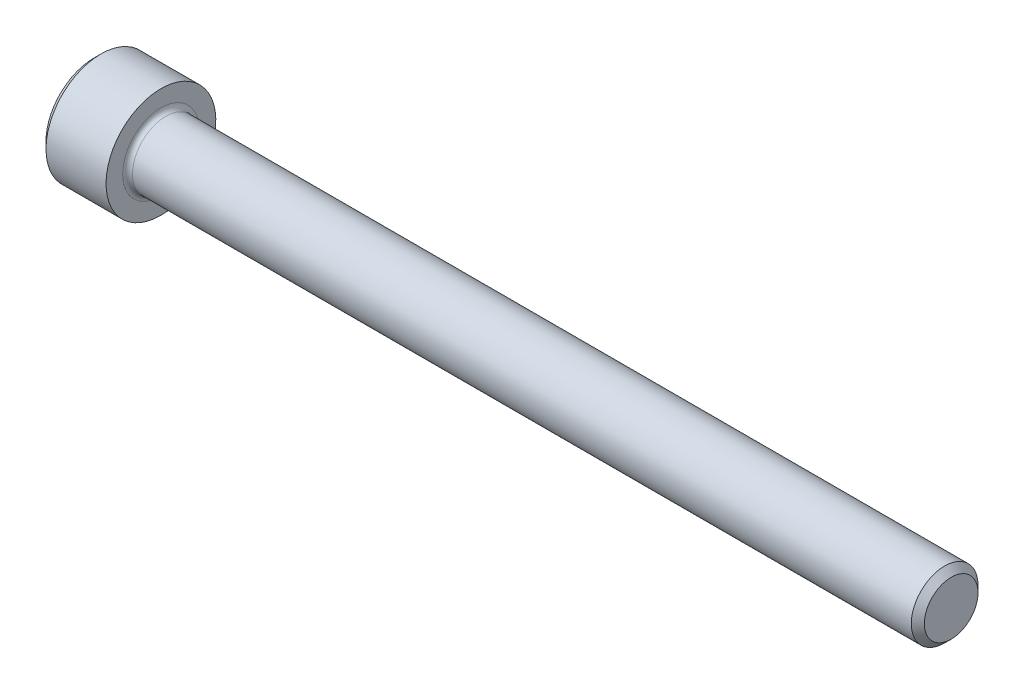
ISO-10303-21;
HEADER;
FILE_DESCRIPTION(('STEP AP214'),'2;1');
FILE_NAME('part.step','',(''),(''),'','','');
FILE_SCHEMA(('AUTOMOTIVE_DESIGN { 1 0 10303 214 1 1 1 1 }'));
ENDSEC;
DATA;
#1=APPLICATION_CONTEXT('core data for automotive mechanical design processes');
#2=APPLICATION_PROTOCOL_DEFINITION('international standard','automotive_design',2000,#1);
#3=PRODUCT_CONTEXT('',#1,'mechanical');
#4=PRODUCT('Part','Part','',(#3));
#5=PRODUCT_RELATED_PRODUCT_CATEGORY('part','',(#4));
#6=PRODUCT_DEFINITION_FORMATION('','',#4);
#7=PRODUCT_DEFINITION_CONTEXT('part definition',#1,'design');
#8=PRODUCT_DEFINITION('design','',#6,#7);
#9=PRODUCT_DEFINITION_SHAPE('','',#8);
#10=(LENGTH_UNIT() NAMED_UNIT(*) SI_UNIT(.MILLI.,.METRE.));
#11=(NAMED_UNIT(*) PLANE_ANGLE_UNIT() SI_UNIT($,.RADIAN.));
#12=(NAMED_UNIT(*) SI_UNIT($,.STERADIAN.) SOLID_ANGLE_UNIT());
#13=UNCERTAINTY_MEASURE_WITH_UNIT(LENGTH_MEASURE(1.E-05),#10,'distance_accuracy_value','');
#14=(GEOMETRIC_REPRESENTATION_CONTEXT(3) GLOBAL_UNCERTAINTY_ASSIGNED_CONTEXT((#13)) GLOBAL_UNIT_ASSIGNED_CONTEXT((#10,
#11,#12)) REPRESENTATION_CONTEXT('',''));
#15=CARTESIAN_POINT('',(0.,0.,0.));
#16=DIRECTION('',(0.,0.,1.));
#17=DIRECTION('',(1.,0.,0.));
#18=AXIS2_PLACEMENT_3D('',#15,#16,#17);
#19=CARTESIAN_POINT('',(2.28599999999835,1.14604605784489,1.98500999999814));
#20=DIRECTION('',(-1.,0.,0.));
#21=DIRECTION('',(0.,0.,1.));
#22=AXIS2_PLACEMENT_3D('',#19,#20,#21);
#23=PLANE('',#22);
#24=DIRECTION('',(0.,0.500000000000225,0.866025403784309));
#25=VECTOR('',#24,1.);
#26=CARTESIAN_POINT('',(2.28599999999835,-1.71906908676475,0.992504999998419));
#27=LINE('',#26,#25);
#28=CARTESIAN_POINT('',(2.2860000000244,-1.71906908676435,0.992504999999121));
#29=VERTEX_POINT('',#28);
#30=CARTESIAN_POINT('',(2.2859999999985,-1.14604605784269,1.98500999999785));
#31=VERTEX_POINT('',#30);
#32=EDGE_CURVE('E101',#29,#31,#27,.T.);
#33=ORIENTED_EDGE('',*,*,#32,.T.);
#34=DIRECTION('',(0.,1.,0.));
#35=VECTOR('',#34,1.);
#36=CARTESIAN_POINT('',(2.28599999999835,1.14604605784489,1.98500999999737));
#37=LINE('',#36,#35);
#38=CARTESIAN_POINT('',(2.28600000005282,6.16970951828022E-13,1.98500999997034));
#39=VERTEX_POINT('',#38);
#40=EDGE_CURVE('E96',#31,#39,#37,.T.);
#41=ORIENTED_EDGE('',*,*,#40,.T.);
#42=CARTESIAN_POINT('',(2.28600000005045,5.68989300120264E-13,0.));
#43=DIRECTION('',(-1.,0.,0.));
#44=DIRECTION('',(0.,-1.,0.));
#45=AXIS2_PLACEMENT_3D('',#42,#43,#44);
#46=CIRCLE('',#45,1.98500999999842);
#47=EDGE_CURVE('E98',#39,#29,#46,.F.);
#48=ORIENTED_EDGE('',*,*,#47,.T.);
#49=EDGE_LOOP('',(#33,#41,#48));
#50=FACE_BOUND('',#49,.T.);
#51=ADVANCED_FACE('F17',(#50),#23,.T.);
#52=CARTESIAN_POINT('',(2.28599999999835,1.14604605784489,1.98500999999814));
#53=DIRECTION('',(-1.,0.,0.));
#54=DIRECTION('',(0.,0.,1.));
#55=AXIS2_PLACEMENT_3D('',#52,#53,#54);
#56=PLANE('',#55);
#57=DIRECTION('',(0.,-0.499999999999518,0.866025403784717));
#58=VECTOR('',#57,1.);
#59=CARTESIAN_POINT('',(2.28599999999836,-1.71906908676538,-0.992505000001581));
#60=LINE('',#59,#58);
#61=CARTESIAN_POINT('',(2.28600000002441,-1.71906908676604,-0.992505000000433));
#62=VERTEX_POINT('',#61);
#63=CARTESIAN_POINT('',(2.28599999999843,-2.2920921156869,-1.20750667849807E-12));
#64=VERTEX_POINT('',#63);
#65=EDGE_CURVE('E105',#62,#64,#60,.T.);
#66=ORIENTED_EDGE('',*,*,#65,.T.);
#67=DIRECTION('',(0.,0.500000000000257,0.86602540378429));
#68=VECTOR('',#67,1.);
#69=CARTESIAN_POINT('',(2.28599999999835,-2.29209211568694,-1.14318277066872E-12));
#70=LINE('',#69,#68);
#71=EDGE_CURVE('E172',#64,#29,#70,.T.);
#72=ORIENTED_EDGE('',*,*,#71,.T.);
#73=CARTESIAN_POINT('',(2.28600000005045,5.68989300120264E-13,0.));
#74=DIRECTION('',(-1.,0.,0.));
#75=DIRECTION('',(0.,-1.,0.));
#76=AXIS2_PLACEMENT_3D('',#73,#74,#75);
#77=CIRCLE('',#76,1.98500999999842);
#78=EDGE_CURVE('E117',#29,#62,#77,.F.);
#79=ORIENTED_EDGE('',*,*,#78,.T.);
#80=EDGE_LOOP('',(#66,#72,#79));
#81=FACE_BOUND('',#80,.T.);
#82=ADVANCED_FACE('F348',(#81),#56,.T.);
#83=CARTESIAN_POINT('',(2.28599999999835,1.14604605784489,1.98500999999814));
#84=DIRECTION('',(-1.,0.,0.));
#85=DIRECTION('',(0.,0.,1.));
#86=AXIS2_PLACEMENT_3D('',#83,#84,#85);
#87=PLANE('',#86);
#88=DIRECTION('',(0.,1.,0.));
#89=VECTOR('',#88,1.);
#90=CARTESIAN_POINT('',(2.28599999999838,1.14604605784489,-1.98501000000155));
#91=LINE('',#90,#89);
#92=CARTESIAN_POINT('',(2.28600000002441,2.17891246317544E-12,-1.98500999999995));
#93=VERTEX_POINT('',#92);
#94=CARTESIAN_POINT('',(2.28599999999847,-1.14604605784331,-1.98501000000144));
#95=VERTEX_POINT('',#94);
#96=EDGE_CURVE('E167',#93,#95,#91,.F.);
#97=ORIENTED_EDGE('',*,*,#96,.T.);
#98=DIRECTION('',(0.,-0.499999999999995,0.866025403784441));
#99=VECTOR('',#98,1.);
#100=CARTESIAN_POINT('',(2.28599999999837,-1.14604605784323,-1.98501000000176));
#101=LINE('',#100,#99);
#102=EDGE_CURVE('E162',#95,#62,#101,.T.);
#103=ORIENTED_EDGE('',*,*,#102,.T.);
#104=CARTESIAN_POINT('',(2.28600000005045,5.68989300120264E-13,0.));
#105=DIRECTION('',(-1.,0.,0.));
#106=DIRECTION('',(0.,-1.,0.));
#107=AXIS2_PLACEMENT_3D('',#104,#105,#106);
#108=CIRCLE('',#107,1.98500999999842);
#109=EDGE_CURVE('E225',#62,#93,#108,.F.);
#110=ORIENTED_EDGE('',*,*,#109,.T.);
#111=EDGE_LOOP('',(#97,#103,#110));
#112=FACE_BOUND('',#111,.T.);
#113=ADVANCED_FACE('F345',(#112),#87,.T.);
#114=CARTESIAN_POINT('',(2.28599999999835,1.14604605784489,1.98500999999814));
#115=DIRECTION('',(-1.,0.,0.));
#116=DIRECTION('',(0.,0.,1.));
#117=AXIS2_PLACEMENT_3D('',#114,#115,#116);
#118=PLANE('',#117);
#119=DIRECTION('',(0.,-0.49999999999959,-0.866025403784675));
#120=VECTOR('',#119,1.);
#121=CARTESIAN_POINT('',(2.28599999999837,1.71906908676735,-0.992504999999861));
#122=LINE('',#121,#120);
#123=CARTESIAN_POINT('',(2.28600000002441,1.71906908676674,-0.99250500000091));
#124=VERTEX_POINT('',#123);
#125=CARTESIAN_POINT('',(2.28599999999829,1.14604605784539,-1.98501000000123));
#126=VERTEX_POINT('',#125);
#127=EDGE_CURVE('E157',#124,#126,#122,.T.);
#128=ORIENTED_EDGE('',*,*,#127,.T.);
#129=DIRECTION('',(0.,1.,0.));
#130=VECTOR('',#129,1.);
#131=CARTESIAN_POINT('',(2.28599999999838,1.14604605784489,-1.98501000000112));
#132=LINE('',#131,#130);
#133=EDGE_CURVE('E152',#126,#93,#132,.F.);
#134=ORIENTED_EDGE('',*,*,#133,.T.);
#135=CARTESIAN_POINT('',(2.28600000005045,5.68989300120264E-13,0.));
#136=DIRECTION('',(-1.,0.,0.));
#137=DIRECTION('',(0.,-1.,0.));
#138=AXIS2_PLACEMENT_3D('',#135,#136,#137);
#139=CIRCLE('',#138,1.98500999999842);
#140=EDGE_CURVE('E222',#93,#124,#139,.F.);
#141=ORIENTED_EDGE('',*,*,#140,.T.);
#142=EDGE_LOOP('',(#128,#134,#141));
#143=FACE_BOUND('',#142,.T.);
#144=ADVANCED_FACE('F341',(#143),#118,.T.);
#145=CARTESIAN_POINT('',(2.28599999999835,1.14604605784489,1.98500999999814));
#146=DIRECTION('',(-1.,0.,0.));
#147=DIRECTION('',(0.,0.,1.));
#148=AXIS2_PLACEMENT_3D('',#145,#146,#147);
#149=PLANE('',#148);
#150=DIRECTION('',(0.,0.499999999999661,-0.866025403784634));
#151=VECTOR('',#150,1.);
#152=CARTESIAN_POINT('',(2.28599999999836,1.71906908676721,0.99250499999967));
#153=LINE('',#152,#151);
#154=CARTESIAN_POINT('',(2.28600000002441,1.71906908676643,0.992504999999222));
#155=VERTEX_POINT('',#154);
#156=CARTESIAN_POINT('',(2.28599999999834,2.29209211568984,-1.46634293093318E-12));
#157=VERTEX_POINT('',#156);
#158=EDGE_CURVE('E147',#155,#157,#153,.T.);
#159=ORIENTED_EDGE('',*,*,#158,.T.);
#160=DIRECTION('',(0.,-0.5000000000009,-0.866025403783919));
#161=VECTOR('',#160,1.);
#162=CARTESIAN_POINT('',(2.28599999999837,2.29209211568962,-1.85441939581921E-12));
#163=LINE('',#162,#161);
#164=EDGE_CURVE('E118',#157,#124,#163,.T.);
#165=ORIENTED_EDGE('',*,*,#164,.T.);
#166=CARTESIAN_POINT('',(2.28600000005045,5.68989300120264E-13,0.));
#167=DIRECTION('',(-1.,0.,0.));
#168=DIRECTION('',(0.,-1.,0.));
#169=AXIS2_PLACEMENT_3D('',#166,#167,#168);
#170=CIRCLE('',#169,1.98500999999842);
#171=EDGE_CURVE('E125',#124,#155,#170,.F.);
#172=ORIENTED_EDGE('',*,*,#171,.T.);
#173=EDGE_LOOP('',(#159,#165,#172));
#174=FACE_BOUND('',#173,.T.);
#175=ADVANCED_FACE('F337',(#174),#149,.T.);
#176=CARTESIAN_POINT('',(2.28600000008327,5.68989300120182E-13,0.));
#177=DIRECTION('',(-1.,0.,0.));
#178=DIRECTION('',(0.,-1.,0.));
#179=AXIS2_PLACEMENT_3D('',#176,#177,#178);
#180=CONICAL_SURFACE('',#179,1.98500999994158,1.04719755112651);
#181=CARTESIAN_POINT('',(3.43204605798064,5.66110570412242E-13,-1.70530256582424E-10));
#182=VERTEX_POINT('',#181);
#183=VERTEX_LOOP('',#182);
#184=FACE_BOUND('',#183,.T.);
#185=ORIENTED_EDGE('',*,*,#47,.F.);
#186=CARTESIAN_POINT('',(2.28600000005045,5.68989300120264E-13,0.));
#187=DIRECTION('',(-1.,0.,0.));
#188=DIRECTION('',(0.,-1.,0.));
#189=AXIS2_PLACEMENT_3D('',#186,#187,#188);
#190=CIRCLE('',#189,1.98500999999842);
#191=EDGE_CURVE('E113',#155,#39,#190,.F.);
#192=ORIENTED_EDGE('',*,*,#191,.F.);
#193=ORIENTED_EDGE('',*,*,#171,.F.);
#194=ORIENTED_EDGE('',*,*,#140,.F.);
#195=ORIENTED_EDGE('',*,*,#109,.F.);
#196=ORIENTED_EDGE('',*,*,#78,.F.);
#197=EDGE_LOOP('',(#185,#192,#193,#194,#195,#196));
#198=FACE_BOUND('',#197,.T.);
#199=ADVANCED_FACE('F111',(#184,#198),#180,.F.);
#200=CARTESIAN_POINT('',(2.28599999999835,1.14604605784489,1.98500999999814));
#201=DIRECTION('',(-1.,0.,0.));
#202=DIRECTION('',(0.,0.,1.));
#203=AXIS2_PLACEMENT_3D('',#200,#201,#202);
#204=PLANE('',#203);
#205=DIRECTION('',(0.,-1.,0.));
#206=VECTOR('',#205,1.);
#207=CARTESIAN_POINT('',(2.28599999999971,-1.14604605784296,1.98500999999737));
#208=LINE('',#207,#206);
#209=CARTESIAN_POINT('',(2.28599999999887,1.14604605784516,1.98500999999781));
#210=VERTEX_POINT('',#209);
#211=EDGE_CURVE('E122',#39,#210,#208,.F.);
#212=ORIENTED_EDGE('',*,*,#211,.T.);
#213=DIRECTION('',(0.,0.499999999999962,-0.866025403784461));
#214=VECTOR('',#213,1.);
#215=CARTESIAN_POINT('',(2.28599999999788,2.29209211568962,-1.85441939581921E-12));
#216=LINE('',#215,#214);
#217=EDGE_CURVE('E124',#155,#210,#216,.F.);
#218=ORIENTED_EDGE('',*,*,#217,.F.);
#219=ORIENTED_EDGE('',*,*,#191,.T.);
#220=EDGE_LOOP('',(#212,#218,#219));
#221=FACE_BOUND('',#220,.T.);
#222=ADVANCED_FACE('F121',(#221),#204,.T.);
#223=CARTESIAN_POINT('',(2.28599999999811,2.29209211568962,-1.85441939581921E-12));
#224=DIRECTION('',(0.,-0.866025403784461,-0.499999999999962));
#225=DIRECTION('',(0.,0.499999999999962,-0.866025403784461));
#226=AXIS2_PLACEMENT_3D('',#223,#224,#225);
#227=PLANE('',#226);
#228=ORIENTED_EDGE('',*,*,#217,.T.);
#229=DIRECTION('',(1.,0.,0.));
#230=VECTOR('',#229,1.);
#231=CARTESIAN_POINT('',(2.2859999999998,1.14604605784489,1.98500999999745));
#232=LINE('',#231,#230);
#233=CARTESIAN_POINT('',(-1.2572594047228E-12,1.14604605784547,1.98500999999848));
#234=VERTEX_POINT('',#233);
#235=EDGE_CURVE('E130',#210,#234,#232,.F.);
#236=ORIENTED_EDGE('',*,*,#235,.T.);
#237=DIRECTION('',(0.,-0.500000000000009,0.866025403784434));
#238=VECTOR('',#237,1.);
#239=CARTESIAN_POINT('',(0.,2.29209211569044,-7.75421393761609E-13));
#240=LINE('',#239,#238);
#241=CARTESIAN_POINT('',(-1.16700531643483E-12,2.29209211568985,-1.06945976891909E-12));
#242=VERTEX_POINT('',#241);
#243=EDGE_CURVE('E137',#242,#234,#240,.T.);
#244=ORIENTED_EDGE('',*,*,#243,.F.);
#245=DIRECTION('',(1.,0.,0.));
#246=VECTOR('',#245,1.);
#247=CARTESIAN_POINT('',(2.28599999999811,2.29209211569029,-6.905694719215E-13));
#248=LINE('',#247,#246);
#249=EDGE_CURVE('E187',#242,#157,#248,.T.);
#250=ORIENTED_EDGE('',*,*,#249,.T.);
#251=ORIENTED_EDGE('',*,*,#158,.F.);
#252=EDGE_LOOP('',(#228,#236,#244,#250,#251));
#253=FACE_BOUND('',#252,.T.);
#254=ADVANCED_FACE('F329',(#253),#227,.T.);
#255=CARTESIAN_POINT('',(2.2859999999998,-1.14604605784296,1.98500999999737));
#256=DIRECTION('',(0.,0.,1.));
#257=DIRECTION('',(0.,-1.,0.));
#258=AXIS2_PLACEMENT_3D('',#255,#256,#257);
#259=PLANE('',#258);
#260=ORIENTED_EDGE('',*,*,#235,.F.);
#261=ORIENTED_EDGE('',*,*,#211,.F.);
#262=ORIENTED_EDGE('',*,*,#40,.F.);
#263=DIRECTION('',(1.,0.,0.));
#264=VECTOR('',#263,1.);
#265=CARTESIAN_POINT('',(2.2859999999998,-1.14604605784213,1.98500999999881));
#266=LINE('',#265,#264);
#267=CARTESIAN_POINT('',(-1.19364663922646E-12,-1.14604605784313,1.98500999999827));
#268=VERTEX_POINT('',#267);
#269=EDGE_CURVE('E132',#268,#31,#266,.T.);
#270=ORIENTED_EDGE('',*,*,#269,.F.);
#271=DIRECTION('',(0.,1.,0.));
#272=VECTOR('',#271,1.);
#273=CARTESIAN_POINT('',(0.,0.,1.98500999999957));
#274=LINE('',#273,#272);
#275=EDGE_CURVE('E363',#234,#268,#274,.F.);
#276=ORIENTED_EDGE('',*,*,#275,.F.);
#277=EDGE_LOOP('',(#260,#261,#262,#270,#276));
#278=FACE_BOUND('',#277,.T.);
#279=ADVANCED_FACE('F128',(#278),#259,.F.);
#280=CARTESIAN_POINT('',(2.2859999999998,-1.14604605784296,1.98500999999737));
#281=DIRECTION('',(0.,0.866025403784442,-0.499999999999995));
#282=DIRECTION('',(0.,0.499999999999995,0.866025403784442));
#283=AXIS2_PLACEMENT_3D('',#280,#281,#282);
#284=PLANE('',#283);
#285=ORIENTED_EDGE('',*,*,#71,.F.);
#286=DIRECTION('',(1.,0.,0.));
#287=VECTOR('',#286,1.);
#288=CARTESIAN_POINT('',(2.28599999999899,-2.29209211568683,-1.33577502339642E-12));
#289=LINE('',#288,#287);
#290=CARTESIAN_POINT('',(-1.1376832416176E-12,-2.29209211568637,-1.26755017421369E-12));
#291=VERTEX_POINT('',#290);
#292=EDGE_CURVE('E198',#291,#64,#289,.T.);
#293=ORIENTED_EDGE('',*,*,#292,.F.);
#294=DIRECTION('',(0.,-0.499999999999382,-0.866025403784796));
#295=VECTOR('',#294,1.);
#296=CARTESIAN_POINT('',(0.,-1.14604605784346,1.98500999999958));
#297=LINE('',#296,#295);
#298=EDGE_CURVE('E361',#268,#291,#297,.T.);
#299=ORIENTED_EDGE('',*,*,#298,.F.);
#300=ORIENTED_EDGE('',*,*,#269,.T.);
#301=ORIENTED_EDGE('',*,*,#32,.F.);
#302=EDGE_LOOP('',(#285,#293,#299,#300,#301));
#303=FACE_BOUND('',#302,.T.);
#304=ADVANCED_FACE('F322',(#303),#284,.T.);
#305=CARTESIAN_POINT('',(2.28599999999899,-2.29209211568694,-1.14318277066872E-12));
#306=DIRECTION('',(0.,0.86602540378446,0.499999999999963));
#307=DIRECTION('',(0.,-0.499999999999963,0.86602540378446));
#308=AXIS2_PLACEMENT_3D('',#305,#306,#307);
#309=PLANE('',#308);
#310=ORIENTED_EDGE('',*,*,#102,.F.);
#311=DIRECTION('',(1.,0.,0.));
#312=VECTOR('',#311,1.);
#313=CARTESIAN_POINT('',(2.28599999999705,-1.14604605784323,-1.9850100000012));
#314=LINE('',#313,#312);
#315=CARTESIAN_POINT('',(-1.28757993453517E-12,-1.14604605784309,-1.98501000000162));
#316=VERTEX_POINT('',#315);
#317=EDGE_CURVE('E191',#95,#316,#314,.F.);
#318=ORIENTED_EDGE('',*,*,#317,.T.);
#319=DIRECTION('',(0.,0.499999999999133,-0.866025403784939));
#320=VECTOR('',#319,1.);
#321=CARTESIAN_POINT('',(0.,-2.29209211568589,-7.91033905045413E-13));
#322=LINE('',#321,#320);
#323=EDGE_CURVE('E358',#291,#316,#322,.T.);
#324=ORIENTED_EDGE('',*,*,#323,.F.);
#325=ORIENTED_EDGE('',*,*,#292,.T.);
#326=ORIENTED_EDGE('',*,*,#65,.F.);
#327=EDGE_LOOP('',(#310,#318,#324,#325,#326));
#328=FACE_BOUND('',#327,.T.);
#329=ADVANCED_FACE('F318',(#328),#309,.T.);
#330=CARTESIAN_POINT('',(2.28599999999705,1.1460460578452,-1.98501000000112));
#331=DIRECTION('',(0.,0.,-1.));
#332=DIRECTION('',(0.,1.,0.));
#333=AXIS2_PLACEMENT_3D('',#330,#331,#332);
#334=PLANE('',#333);
#335=ORIENTED_EDGE('',*,*,#317,.F.);
#336=ORIENTED_EDGE('',*,*,#96,.F.);
#337=ORIENTED_EDGE('',*,*,#133,.F.);
#338=DIRECTION('',(1.,0.,0.));
#339=VECTOR('',#338,1.);
#340=CARTESIAN_POINT('',(2.28599999999811,1.14604605784577,-1.98501000000145));
#341=LINE('',#340,#339);
#342=CARTESIAN_POINT('',(-1.18823711350694E-12,1.14604605784497,-1.98501000000149));
#343=VERTEX_POINT('',#342);
#344=EDGE_CURVE('E190',#126,#343,#341,.F.);
#345=ORIENTED_EDGE('',*,*,#344,.T.);
#346=DIRECTION('',(0.,1.,0.));
#347=VECTOR('',#346,1.);
#348=CARTESIAN_POINT('',(0.,0.,-1.98501000000226));
#349=LINE('',#348,#347);
#350=EDGE_CURVE('E373',#316,#343,#349,.T.);
#351=ORIENTED_EDGE('',*,*,#350,.F.);
#352=EDGE_LOOP('',(#335,#336,#337,#345,#351));
#353=FACE_BOUND('',#352,.T.);
#354=ADVANCED_FACE('F314',(#353),#334,.F.);
#355=CARTESIAN_POINT('',(2.28599999999811,2.29209211568962,-1.85441939581921E-12));
#356=DIRECTION('',(0.,0.866025403784441,-0.499999999999996));
#357=DIRECTION('',(0.,0.499999999999996,0.866025403784441));
#358=AXIS2_PLACEMENT_3D('',#355,#356,#357);
#359=PLANE('',#358);
#360=ORIENTED_EDGE('',*,*,#344,.F.);
#361=ORIENTED_EDGE('',*,*,#127,.F.);
#362=ORIENTED_EDGE('',*,*,#164,.F.);
#363=ORIENTED_EDGE('',*,*,#249,.F.);
#364=DIRECTION('',(0.,0.500000000000299,0.866025403784266));
#365=VECTOR('',#364,1.);
#366=CARTESIAN_POINT('',(0.,1.14604605784477,-1.98501000000192));
#367=LINE('',#366,#365);
#368=EDGE_CURVE('E218',#343,#242,#367,.T.);
#369=ORIENTED_EDGE('',*,*,#368,.F.);
#370=EDGE_LOOP('',(#360,#361,#362,#363,#369));
#371=FACE_BOUND('',#370,.T.);
#372=ADVANCED_FACE('F310',(#371),#359,.F.);
#373=CARTESIAN_POINT('',(0.,0.,0.));
#374=DIRECTION('',(-1.,0.,0.));
#375=DIRECTION('',(0.,0.,1.));
#376=AXIS2_PLACEMENT_3D('',#373,#374,#375);
#377=PLANE('',#376);
#378=CARTESIAN_POINT('',(0.,0.,0.));
#379=DIRECTION('',(1.,0.,0.));
#380=DIRECTION('',(0.,1.,0.));
#381=AXIS2_PLACEMENT_3D('',#378,#379,#380);
#382=CIRCLE('',#381,3.48615000001473);
#383=CARTESIAN_POINT('',(0.,3.48615000001473,0.));
#384=VERTEX_POINT('',#383);
#385=EDGE_CURVE('E216',#384,#384,#382,.T.);
#386=ORIENTED_EDGE('',*,*,#385,.F.);
#387=EDGE_LOOP('',(#386));
#388=FACE_BOUND('',#387,.T.);
#389=ORIENTED_EDGE('',*,*,#350,.T.);
#390=ORIENTED_EDGE('',*,*,#368,.T.);
#391=ORIENTED_EDGE('',*,*,#243,.T.);
#392=ORIENTED_EDGE('',*,*,#275,.T.);
#393=ORIENTED_EDGE('',*,*,#298,.T.);
#394=ORIENTED_EDGE('',*,*,#323,.T.);
#395=EDGE_LOOP('',(#389,#390,#391,#392,#393,#394));
#396=FACE_BOUND('',#395,.T.);
#397=ADVANCED_FACE('F302',(#388,#396),#377,.T.);
#398=CARTESIAN_POINT('',(0.482600000054852,0.,0.));
#399=DIRECTION('',(1.,0.,0.));
#400=DIRECTION('',(0.,1.,0.));
#401=AXIS2_PLACEMENT_3D('',#398,#399,#400);
#402=CONICAL_SURFACE('',#401,3.96875000012642,0.785398163456339);
#403=ORIENTED_EDGE('',*,*,#385,.T.);
#404=EDGE_LOOP('',(#403));
#405=FACE_BOUND('',#404,.T.);
#406=CARTESIAN_POINT('',(0.482599999998258,8.76602948562954E-13,-7.99881882951326E-13));
#407=DIRECTION('',(-1.,0.,0.));
#408=DIRECTION('',(0.,-1.,0.));
#409=AXIS2_PLACEMENT_3D('',#406,#407,#408);
#410=CIRCLE('',#409,3.96874999999993);
#411=CARTESIAN_POINT('',(0.482599999998248,-3.96874999999905,-7.99881882951326E-13));
#412=VERTEX_POINT('',#411);
#413=EDGE_CURVE('E215',#412,#412,#410,.F.);
#414=ORIENTED_EDGE('',*,*,#413,.F.);
#415=EDGE_LOOP('',(#414));
#416=FACE_BOUND('',#415,.T.);
#417=ADVANCED_FACE('F297',(#405,#416),#402,.T.);
#418=CARTESIAN_POINT('',(-31.7500000000019,9.57567358739198E-13,-7.37257477290143E-13));
#419=DIRECTION('',(-1.,0.,0.));
#420=DIRECTION('',(0.,-1.,0.));
#421=AXIS2_PLACEMENT_3D('',#418,#419,#420);
#422=CYLINDRICAL_SURFACE('',#421,3.96874999999993);
#423=CARTESIAN_POINT('',(4.8259999999988,8.65692850737785E-13,-8.08320632650351E-13));
#424=DIRECTION('',(-1.,0.,0.));
#425=DIRECTION('',(0.,-1.,0.));
#426=AXIS2_PLACEMENT_3D('',#423,#424,#425);
#427=CIRCLE('',#426,3.96874999999993);
#428=CARTESIAN_POINT('',(4.82599999999879,-3.96874999999906,-8.08320632650351E-13));
#429=VERTEX_POINT('',#428);
#430=EDGE_CURVE('E212',#429,#429,#427,.F.);
#431=ORIENTED_EDGE('',*,*,#430,.F.);
#432=EDGE_LOOP('',(#431));
#433=FACE_BOUND('',#432,.T.);
#434=ORIENTED_EDGE('',*,*,#413,.T.);
#435=EDGE_LOOP('',(#434));
#436=FACE_BOUND('',#435,.T.);
#437=ADVANCED_FACE('F293',(#433,#436),#422,.T.);
#438=CARTESIAN_POINT('',(61.9759999999986,1.94056000000149,-1.88737914186277E-12));
#439=DIRECTION('',(1.,0.,0.));
#440=DIRECTION('',(0.,0.,-1.));
#441=AXIS2_PLACEMENT_3D('',#438,#439,#440);
#442=PLANE('',#441);
#443=CARTESIAN_POINT('',(61.9760000000166,9.30319214325882E-13,-1.00874170128051E-12));
#444=DIRECTION('',(-1.,0.,0.));
#445=DIRECTION('',(0.,-1.,0.));
#446=AXIS2_PLACEMENT_3D('',#443,#444,#445);
#447=CIRCLE('',#446,1.94056000003684);
#448=CARTESIAN_POINT('',(61.9760000000166,-1.94056000003591,-1.00874170128051E-12));
#449=VERTEX_POINT('',#448);
#450=EDGE_CURVE('E208',#449,#449,#447,.T.);
#451=ORIENTED_EDGE('',*,*,#450,.F.);
#452=EDGE_LOOP('',(#451));
#453=FACE_BOUND('',#452,.T.);
#454=ADVANCED_FACE('F251',(#453),#442,.T.);
#455=CARTESIAN_POINT('',(4.82599999999796,3.96875000000166,-1.21083698623181E-12));
#456=DIRECTION('',(1.,0.,0.));
#457=DIRECTION('',(0.,0.,-1.));
#458=AXIS2_PLACEMENT_3D('',#455,#456,#457);
#459=PLANE('',#458);
#460=ORIENTED_EDGE('',*,*,#430,.T.);
#461=EDGE_LOOP('',(#460));
#462=FACE_BOUND('',#461,.T.);
#463=CARTESIAN_POINT('',(4.82599999999899,1.40254979297261E-12,-1.49811019145574E-12));
#464=DIRECTION('',(1.,0.,0.));
#465=DIRECTION('',(0.,0.,1.));
#466=AXIS2_PLACEMENT_3D('',#463,#464,#465);
#467=CIRCLE('',#466,2.76859999999918);
#468=CARTESIAN_POINT('',(4.82599999999858,1.30729574387978E-12,-2.76860000000099));
#469=VERTEX_POINT('',#468);
#470=CARTESIAN_POINT('',(4.82599999999857,1.21938066482068E-12,2.76859999999859));
#471=VERTEX_POINT('',#470);
#472=EDGE_CURVE('E211',#469,#471,#467,.F.);
#473=ORIENTED_EDGE('',*,*,#472,.T.);
#474=CARTESIAN_POINT('',(4.82599999999899,1.40254979297261E-12,-1.49811019145574E-12));
#475=DIRECTION('',(1.,0.,0.));
#476=DIRECTION('',(0.,0.,-1.));
#477=AXIS2_PLACEMENT_3D('',#474,#475,#476);
#478=CIRCLE('',#477,2.76859999999995);
#479=EDGE_CURVE('E36',#471,#469,#478,.F.);
#480=ORIENTED_EDGE('',*,*,#479,.T.);
#481=EDGE_LOOP('',(#473,#480));
#482=FACE_BOUND('',#481,.T.);
#483=ADVANCED_FACE('F232',(#462,#482),#459,.T.);
#484=CARTESIAN_POINT('',(61.5035600000056,9.30998495518567E-13,-1.00874170128051E-12));
#485=DIRECTION('',(-1.,0.,0.));
#486=DIRECTION('',(0.,-1.,0.));
#487=AXIS2_PLACEMENT_3D('',#484,#485,#486);
#488=CONICAL_SURFACE('',#487,2.4130000001047,0.785398163457608);
#489=CARTESIAN_POINT('',(61.5035599999967,7.23325644380605E-13,-9.18438913810601E-13));
#490=DIRECTION('',(-1.,0.,0.));
#491=DIRECTION('',(0.,-1.,0.));
#492=AXIS2_PLACEMENT_3D('',#489,#490,#491);
#493=CIRCLE('',#492,2.41299999999993);
#494=CARTESIAN_POINT('',(61.5035599999967,-2.41299999999921,-9.18438913810601E-13));
#495=VERTEX_POINT('',#494);
#496=EDGE_CURVE('E28',#495,#495,#493,.T.);
#497=ORIENTED_EDGE('',*,*,#496,.F.);
#498=EDGE_LOOP('',(#497));
#499=FACE_BOUND('',#498,.T.);
#500=ORIENTED_EDGE('',*,*,#450,.T.);
#501=EDGE_LOOP('',(#500));
#502=FACE_BOUND('',#501,.T.);
#503=ADVANCED_FACE('F250',(#499,#502),#488,.T.);
#504=CARTESIAN_POINT('',(5.18159999999899,1.40165656858926E-12,-1.49880108324396E-12));
#505=DIRECTION('',(1.,0.,0.));
#506=DIRECTION('',(0.,0.,-1.));
#507=AXIS2_PLACEMENT_3D('',#504,#505,#506);
#508=TOROIDAL_SURFACE('',#507,2.76859999999998,0.3556);
#509=CARTESIAN_POINT('',(5.18159999999899,8.64799626354438E-13,-8.09011524438576E-13));
#510=DIRECTION('',(-1.,0.,0.));
#511=DIRECTION('',(0.,-1.,0.));
#512=AXIS2_PLACEMENT_3D('',#509,#510,#511);
#513=CIRCLE('',#512,2.41299999999993);
#514=CARTESIAN_POINT('',(5.18159999999898,-2.41299999999907,-8.09011524438576E-13));
#515=VERTEX_POINT('',#514);
#516=EDGE_CURVE('E11',#515,#515,#513,.F.);
#517=ORIENTED_EDGE('',*,*,#516,.F.);
#518=EDGE_LOOP('',(#517));
#519=FACE_BOUND('',#518,.T.);
#520=ORIENTED_EDGE('',*,*,#472,.F.);
#521=ORIENTED_EDGE('',*,*,#479,.F.);
#522=EDGE_LOOP('',(#520,#521));
#523=FACE_BOUND('',#522,.T.);
#524=ADVANCED_FACE('F229',(#519,#523),#508,.F.);
#525=CARTESIAN_POINT('',(-31.7500000000019,9.57567358739198E-13,-7.37257477290143E-13));
#526=DIRECTION('',(-1.,0.,0.));
#527=DIRECTION('',(0.,-1.,0.));
#528=AXIS2_PLACEMENT_3D('',#525,#526,#527);
#529=CYLINDRICAL_SURFACE('',#528,2.41299999999993);
#530=ORIENTED_EDGE('',*,*,#516,.T.);
#531=EDGE_LOOP('',(#530));
#532=FACE_BOUND('',#531,.T.);
#533=ORIENTED_EDGE('',*,*,#496,.T.);
#534=EDGE_LOOP('',(#533));
#535=FACE_BOUND('',#534,.T.);
#536=ADVANCED_FACE('F275',(#532,#535),#529,.T.);
#537=CLOSED_SHELL('',(#51,#82,#113,#144,#175,#199,#222,#254,#279,#304,#329,#354,#372,#397,#417,
#437,#454,#483,#503,#524,#536));
#538=MANIFOLD_SOLID_BREP('B1',#537);
#539=ADVANCED_BREP_SHAPE_REPRESENTATION('',(#18,#538),#14);
#540=SHAPE_DEFINITION_REPRESENTATION(#9,#539);
ENDSEC;
END-ISO-10303-21;
